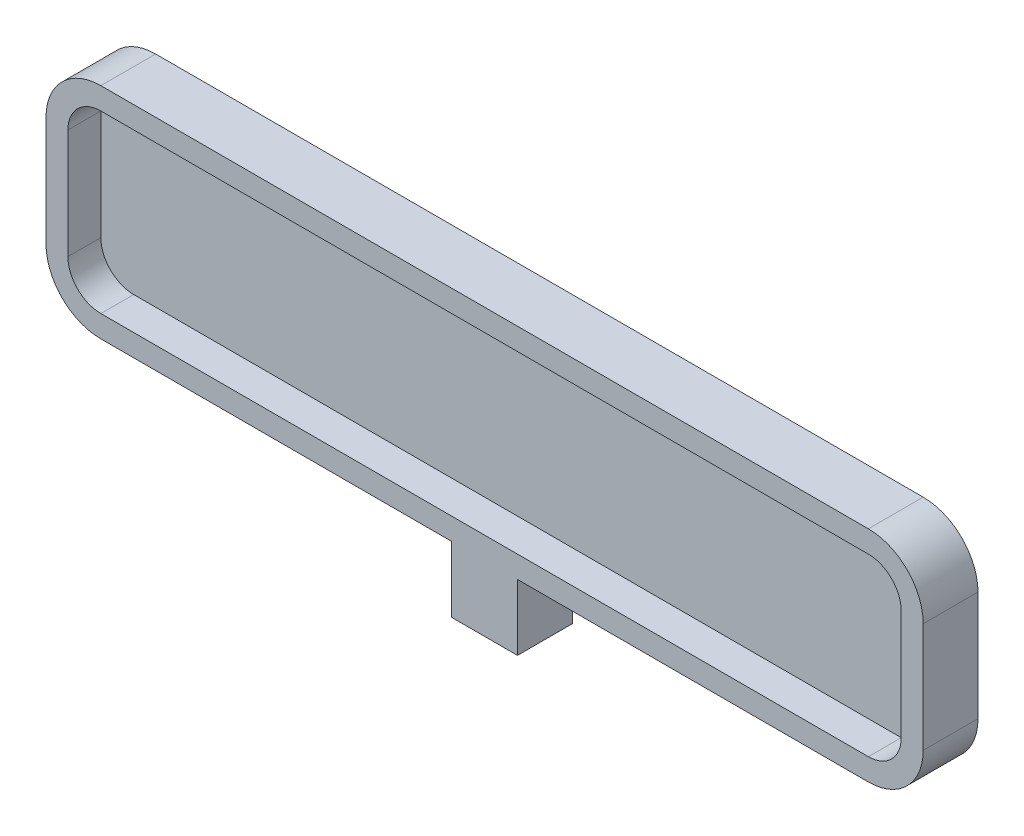
ISO-10303-21;
HEADER;
FILE_DESCRIPTION(('STEP AP214'),'2;1');
FILE_NAME('part.step','',(''),(''),'','','');
FILE_SCHEMA(('AUTOMOTIVE_DESIGN { 1 0 10303 214 1 1 1 1 }'));
ENDSEC;
DATA;
#1=APPLICATION_CONTEXT('core data for automotive mechanical design processes');
#2=APPLICATION_PROTOCOL_DEFINITION('international standard','automotive_design',2000,#1);
#3=PRODUCT_CONTEXT('',#1,'mechanical');
#4=PRODUCT('Part','Part','',(#3));
#5=PRODUCT_RELATED_PRODUCT_CATEGORY('part','',(#4));
#6=PRODUCT_DEFINITION_FORMATION('','',#4);
#7=PRODUCT_DEFINITION_CONTEXT('part definition',#1,'design');
#8=PRODUCT_DEFINITION('design','',#6,#7);
#9=PRODUCT_DEFINITION_SHAPE('','',#8);
#10=(LENGTH_UNIT() NAMED_UNIT(*) SI_UNIT(.MILLI.,.METRE.));
#11=(NAMED_UNIT(*) PLANE_ANGLE_UNIT() SI_UNIT($,.RADIAN.));
#12=(NAMED_UNIT(*) SI_UNIT($,.STERADIAN.) SOLID_ANGLE_UNIT());
#13=UNCERTAINTY_MEASURE_WITH_UNIT(LENGTH_MEASURE(1.E-05),#10,'distance_accuracy_value','');
#14=(GEOMETRIC_REPRESENTATION_CONTEXT(3) GLOBAL_UNCERTAINTY_ASSIGNED_CONTEXT((#13)) GLOBAL_UNIT_ASSIGNED_CONTEXT((#10,
#11,#12)) REPRESENTATION_CONTEXT('',''));
#15=CARTESIAN_POINT('',(0.,0.,0.));
#16=DIRECTION('',(0.,0.,1.));
#17=DIRECTION('',(1.,0.,0.));
#18=AXIS2_PLACEMENT_3D('',#15,#16,#17);
#19=CARTESIAN_POINT('',(40.,-9.99999999999999,5.));
#20=DIRECTION('',(0.,1.,0.));
#21=DIRECTION('',(-1.,0.,0.));
#22=AXIS2_PLACEMENT_3D('',#19,#20,#21);
#23=PLANE('',#22);
#24=DIRECTION('',(0.,0.,-1.));
#25=VECTOR('',#24,1.);
#26=CARTESIAN_POINT('',(-3.,-10.,0.));
#27=LINE('',#26,#25);
#28=CARTESIAN_POINT('',(-3.,-10.,5.));
#29=VERTEX_POINT('',#28);
#30=CARTESIAN_POINT('',(-3.,-10.,0.));
#31=VERTEX_POINT('',#30);
#32=EDGE_CURVE('E63',#29,#31,#27,.T.);
#33=ORIENTED_EDGE('',*,*,#32,.F.);
#34=DIRECTION('',(1.,0.,0.));
#35=VECTOR('',#34,1.);
#36=CARTESIAN_POINT('',(40.,-9.99999999999999,5.));
#37=LINE('',#36,#35);
#38=CARTESIAN_POINT('',(-35.,-10.,5.));
#39=VERTEX_POINT('',#38);
#40=EDGE_CURVE('E301',#39,#29,#37,.T.);
#41=ORIENTED_EDGE('',*,*,#40,.F.);
#42=DIRECTION('',(0.,0.,-1.));
#43=VECTOR('',#42,1.);
#44=CARTESIAN_POINT('',(-35.,-10.,5.));
#45=LINE('',#44,#43);
#46=CARTESIAN_POINT('',(-35.,-10.,0.));
#47=VERTEX_POINT('',#46);
#48=EDGE_CURVE('E329',#39,#47,#45,.T.);
#49=ORIENTED_EDGE('',*,*,#48,.T.);
#50=DIRECTION('',(1.,0.,0.));
#51=VECTOR('',#50,1.);
#52=CARTESIAN_POINT('',(40.,-9.99999999999999,0.));
#53=LINE('',#52,#51);
#54=EDGE_CURVE('E317',#47,#31,#53,.T.);
#55=ORIENTED_EDGE('',*,*,#54,.T.);
#56=EDGE_LOOP('',(#33,#41,#49,#55));
#57=FACE_BOUND('',#56,.T.);
#58=ADVANCED_FACE('F39',(#57),#23,.F.);
#59=DIRECTION('',(0.,0.,1.));
#60=VECTOR('',#59,1.);
#61=CARTESIAN_POINT('',(3.,-10.,0.));
#62=LINE('',#61,#60);
#63=CARTESIAN_POINT('',(3.,-10.,0.));
#64=VERTEX_POINT('',#63);
#65=CARTESIAN_POINT('',(3.,-10.,5.));
#66=VERTEX_POINT('',#65);
#67=EDGE_CURVE('E201',#64,#66,#62,.T.);
#68=ORIENTED_EDGE('',*,*,#67,.F.);
#69=CARTESIAN_POINT('',(35.,-9.99999999999999,0.));
#70=VERTEX_POINT('',#69);
#71=EDGE_CURVE('E316',#64,#70,#53,.T.);
#72=ORIENTED_EDGE('',*,*,#71,.T.);
#73=DIRECTION('',(0.,0.,-1.));
#74=VECTOR('',#73,1.);
#75=CARTESIAN_POINT('',(35.,-9.99999999999999,5.));
#76=LINE('',#75,#74);
#77=CARTESIAN_POINT('',(35.,-9.99999999999999,5.));
#78=VERTEX_POINT('',#77);
#79=EDGE_CURVE('E312',#70,#78,#76,.F.);
#80=ORIENTED_EDGE('',*,*,#79,.T.);
#81=EDGE_CURVE('E55',#66,#78,#37,.T.);
#82=ORIENTED_EDGE('',*,*,#81,.F.);
#83=EDGE_LOOP('',(#68,#72,#80,#82));
#84=FACE_BOUND('',#83,.T.);
#85=ADVANCED_FACE('F433',(#84),#23,.F.);
#86=CARTESIAN_POINT('',(-40.,-10.,5.));
#87=DIRECTION('',(1.,0.,0.));
#88=DIRECTION('',(0.,0.,-1.));
#89=AXIS2_PLACEMENT_3D('',#86,#87,#88);
#90=PLANE('',#89);
#91=DIRECTION('',(0.,-1.,0.));
#92=VECTOR('',#91,1.);
#93=CARTESIAN_POINT('',(-40.,-10.,0.));
#94=LINE('',#93,#92);
#95=CARTESIAN_POINT('',(-40.,4.99999999999999,0.));
#96=VERTEX_POINT('',#95);
#97=CARTESIAN_POINT('',(-40.,-5.,0.));
#98=VERTEX_POINT('',#97);
#99=EDGE_CURVE('E269',#96,#98,#94,.T.);
#100=ORIENTED_EDGE('',*,*,#99,.T.);
#101=DIRECTION('',(0.,0.,-1.));
#102=VECTOR('',#101,1.);
#103=CARTESIAN_POINT('',(-40.,-5.,5.));
#104=LINE('',#103,#102);
#105=CARTESIAN_POINT('',(-40.,-5.,5.));
#106=VERTEX_POINT('',#105);
#107=EDGE_CURVE('E350',#98,#106,#104,.F.);
#108=ORIENTED_EDGE('',*,*,#107,.T.);
#109=DIRECTION('',(0.,-1.,0.));
#110=VECTOR('',#109,1.);
#111=CARTESIAN_POINT('',(-40.,-10.,5.));
#112=LINE('',#111,#110);
#113=CARTESIAN_POINT('',(-40.,4.99999999999999,5.));
#114=VERTEX_POINT('',#113);
#115=EDGE_CURVE('E296',#114,#106,#112,.T.);
#116=ORIENTED_EDGE('',*,*,#115,.F.);
#117=DIRECTION('',(0.,0.,-1.));
#118=VECTOR('',#117,1.);
#119=CARTESIAN_POINT('',(-40.,4.99999999999999,5.));
#120=LINE('',#119,#118);
#121=EDGE_CURVE('E346',#114,#96,#120,.T.);
#122=ORIENTED_EDGE('',*,*,#121,.T.);
#123=EDGE_LOOP('',(#100,#108,#116,#122));
#124=FACE_BOUND('',#123,.T.);
#125=ADVANCED_FACE('F387',(#124),#90,.F.);
#126=CARTESIAN_POINT('',(40.,-9.99999999999999,5.));
#127=DIRECTION('',(-1.,0.,0.));
#128=DIRECTION('',(0.,0.,1.));
#129=AXIS2_PLACEMENT_3D('',#126,#127,#128);
#130=PLANE('',#129);
#131=DIRECTION('',(0.,1.,0.));
#132=VECTOR('',#131,1.);
#133=CARTESIAN_POINT('',(40.,-9.99999999999999,5.));
#134=LINE('',#133,#132);
#135=CARTESIAN_POINT('',(40.,-5.,5.));
#136=VERTEX_POINT('',#135);
#137=CARTESIAN_POINT('',(40.,5.,5.));
#138=VERTEX_POINT('',#137);
#139=EDGE_CURVE('E304',#136,#138,#134,.T.);
#140=ORIENTED_EDGE('',*,*,#139,.F.);
#141=DIRECTION('',(0.,0.,-1.));
#142=VECTOR('',#141,1.);
#143=CARTESIAN_POINT('',(40.,-5.,5.));
#144=LINE('',#143,#142);
#145=CARTESIAN_POINT('',(40.,-5.,0.));
#146=VERTEX_POINT('',#145);
#147=EDGE_CURVE('E368',#136,#146,#144,.T.);
#148=ORIENTED_EDGE('',*,*,#147,.T.);
#149=DIRECTION('',(0.,1.,0.));
#150=VECTOR('',#149,1.);
#151=CARTESIAN_POINT('',(40.,-9.99999999999999,0.));
#152=LINE('',#151,#150);
#153=CARTESIAN_POINT('',(40.,5.,0.));
#154=VERTEX_POINT('',#153);
#155=EDGE_CURVE('E320',#146,#154,#152,.T.);
#156=ORIENTED_EDGE('',*,*,#155,.T.);
#157=DIRECTION('',(0.,0.,-1.));
#158=VECTOR('',#157,1.);
#159=CARTESIAN_POINT('',(40.,5.,5.));
#160=LINE('',#159,#158);
#161=EDGE_CURVE('E365',#154,#138,#160,.F.);
#162=ORIENTED_EDGE('',*,*,#161,.T.);
#163=EDGE_LOOP('',(#140,#148,#156,#162));
#164=FACE_BOUND('',#163,.T.);
#165=ADVANCED_FACE('F440',(#164),#130,.F.);
#166=CARTESIAN_POINT('',(40.,10.,5.));
#167=DIRECTION('',(0.,-1.,0.));
#168=DIRECTION('',(1.,0.,0.));
#169=AXIS2_PLACEMENT_3D('',#166,#167,#168);
#170=PLANE('',#169);
#171=DIRECTION('',(-1.,0.,0.));
#172=VECTOR('',#171,1.);
#173=CARTESIAN_POINT('',(40.,10.,5.));
#174=LINE('',#173,#172);
#175=CARTESIAN_POINT('',(35.,10.,5.));
#176=VERTEX_POINT('',#175);
#177=CARTESIAN_POINT('',(-35.,9.99999999999999,5.));
#178=VERTEX_POINT('',#177);
#179=EDGE_CURVE('E308',#176,#178,#174,.T.);
#180=ORIENTED_EDGE('',*,*,#179,.F.);
#181=DIRECTION('',(0.,0.,-1.));
#182=VECTOR('',#181,1.);
#183=CARTESIAN_POINT('',(35.,10.,5.));
#184=LINE('',#183,#182);
#185=CARTESIAN_POINT('',(35.,10.,0.));
#186=VERTEX_POINT('',#185);
#187=EDGE_CURVE('E11',#176,#186,#184,.T.);
#188=ORIENTED_EDGE('',*,*,#187,.T.);
#189=DIRECTION('',(-1.,0.,0.));
#190=VECTOR('',#189,1.);
#191=CARTESIAN_POINT('',(40.,10.,0.));
#192=LINE('',#191,#190);
#193=CARTESIAN_POINT('',(-35.,9.99999999999999,0.));
#194=VERTEX_POINT('',#193);
#195=EDGE_CURVE('E300',#186,#194,#192,.T.);
#196=ORIENTED_EDGE('',*,*,#195,.T.);
#197=DIRECTION('',(0.,0.,-1.));
#198=VECTOR('',#197,1.);
#199=CARTESIAN_POINT('',(-35.,9.99999999999999,5.));
#200=LINE('',#199,#198);
#201=EDGE_CURVE('E48',#194,#178,#200,.F.);
#202=ORIENTED_EDGE('',*,*,#201,.T.);
#203=EDGE_LOOP('',(#180,#188,#196,#202));
#204=FACE_BOUND('',#203,.T.);
#205=ADVANCED_FACE('F375',(#204),#170,.F.);
#206=CARTESIAN_POINT('',(0.,0.,5.));
#207=DIRECTION('',(0.,0.,1.));
#208=DIRECTION('',(1.,0.,0.));
#209=AXIS2_PLACEMENT_3D('',#206,#207,#208);
#210=PLANE('',#209);
#211=DIRECTION('',(0.,-1.,0.));
#212=VECTOR('',#211,1.);
#213=CARTESIAN_POINT('',(-38.,-10.,5.));
#214=LINE('',#213,#212);
#215=CARTESIAN_POINT('',(-38.,4.99999999999999,5.));
#216=VERTEX_POINT('',#215);
#217=CARTESIAN_POINT('',(-38.,-5.,5.));
#218=VERTEX_POINT('',#217);
#219=EDGE_CURVE('E241',#216,#218,#214,.T.);
#220=ORIENTED_EDGE('',*,*,#219,.F.);
#221=CARTESIAN_POINT('',(-35.,4.99999999999999,5.));
#222=DIRECTION('',(0.,0.,1.));
#223=DIRECTION('',(1.,0.,0.));
#224=AXIS2_PLACEMENT_3D('',#221,#222,#223);
#225=CIRCLE('',#224,3.);
#226=CARTESIAN_POINT('',(-35.,7.99999999999999,5.));
#227=VERTEX_POINT('',#226);
#228=EDGE_CURVE('E219',#227,#216,#225,.T.);
#229=ORIENTED_EDGE('',*,*,#228,.F.);
#230=DIRECTION('',(-1.,0.,0.));
#231=VECTOR('',#230,1.);
#232=CARTESIAN_POINT('',(40.,8.00000000000001,5.));
#233=LINE('',#232,#231);
#234=CARTESIAN_POINT('',(35.,8.00000000000001,5.));
#235=VERTEX_POINT('',#234);
#236=EDGE_CURVE('E255',#235,#227,#233,.T.);
#237=ORIENTED_EDGE('',*,*,#236,.F.);
#238=CARTESIAN_POINT('',(35.,5.,5.));
#239=DIRECTION('',(0.,0.,1.));
#240=DIRECTION('',(1.,0.,0.));
#241=AXIS2_PLACEMENT_3D('',#238,#239,#240);
#242=CIRCLE('',#241,3.);
#243=CARTESIAN_POINT('',(38.,5.,5.));
#244=VERTEX_POINT('',#243);
#245=EDGE_CURVE('E286',#244,#235,#242,.T.);
#246=ORIENTED_EDGE('',*,*,#245,.F.);
#247=DIRECTION('',(0.,1.,0.));
#248=VECTOR('',#247,1.);
#249=CARTESIAN_POINT('',(38.,-9.99999999999999,5.));
#250=LINE('',#249,#248);
#251=CARTESIAN_POINT('',(38.,-5.,5.));
#252=VERTEX_POINT('',#251);
#253=EDGE_CURVE('E283',#252,#244,#250,.T.);
#254=ORIENTED_EDGE('',*,*,#253,.F.);
#255=CARTESIAN_POINT('',(35.,-5.,5.));
#256=DIRECTION('',(0.,0.,1.));
#257=DIRECTION('',(1.,0.,0.));
#258=AXIS2_PLACEMENT_3D('',#255,#256,#257);
#259=CIRCLE('',#258,3.);
#260=CARTESIAN_POINT('',(35.,-7.99999999999999,5.));
#261=VERTEX_POINT('',#260);
#262=EDGE_CURVE('E279',#261,#252,#259,.T.);
#263=ORIENTED_EDGE('',*,*,#262,.F.);
#264=DIRECTION('',(1.,0.,0.));
#265=VECTOR('',#264,1.);
#266=CARTESIAN_POINT('',(40.,-7.99999999999999,5.));
#267=LINE('',#266,#265);
#268=CARTESIAN_POINT('',(-35.,-8.00000000000001,5.));
#269=VERTEX_POINT('',#268);
#270=EDGE_CURVE('E276',#269,#261,#267,.T.);
#271=ORIENTED_EDGE('',*,*,#270,.F.);
#272=CARTESIAN_POINT('',(-35.,-5.,5.));
#273=DIRECTION('',(0.,0.,1.));
#274=DIRECTION('',(1.,0.,0.));
#275=AXIS2_PLACEMENT_3D('',#272,#273,#274);
#276=CIRCLE('',#275,3.);
#277=EDGE_CURVE('E264',#218,#269,#276,.T.);
#278=ORIENTED_EDGE('',*,*,#277,.F.);
#279=EDGE_LOOP('',(#220,#229,#237,#246,#254,#263,#271,#278));
#280=FACE_BOUND('',#279,.T.);
#281=ORIENTED_EDGE('',*,*,#115,.T.);
#282=CARTESIAN_POINT('',(-35.,-5.,5.));
#283=DIRECTION('',(0.,0.,1.));
#284=DIRECTION('',(1.,0.,0.));
#285=AXIS2_PLACEMENT_3D('',#282,#283,#284);
#286=CIRCLE('',#285,5.);
#287=EDGE_CURVE('E362',#106,#39,#286,.T.);
#288=ORIENTED_EDGE('',*,*,#287,.T.);
#289=ORIENTED_EDGE('',*,*,#40,.T.);
#290=DIRECTION('',(0.,1.,0.));
#291=VECTOR('',#290,1.);
#292=CARTESIAN_POINT('',(-3.,-16.,5.));
#293=LINE('',#292,#291);
#294=CARTESIAN_POINT('',(-3.,-16.,5.));
#295=VERTEX_POINT('',#294);
#296=EDGE_CURVE('E393',#295,#29,#293,.T.);
#297=ORIENTED_EDGE('',*,*,#296,.F.);
#298=DIRECTION('',(-1.,0.,0.));
#299=VECTOR('',#298,1.);
#300=CARTESIAN_POINT('',(3.,-16.,5.));
#301=LINE('',#300,#299);
#302=CARTESIAN_POINT('',(3.,-16.,5.));
#303=VERTEX_POINT('',#302);
#304=EDGE_CURVE('E196',#303,#295,#301,.T.);
#305=ORIENTED_EDGE('',*,*,#304,.F.);
#306=DIRECTION('',(0.,1.,0.));
#307=VECTOR('',#306,1.);
#308=CARTESIAN_POINT('',(3.,-16.,5.));
#309=LINE('',#308,#307);
#310=EDGE_CURVE('E212',#303,#66,#309,.T.);
#311=ORIENTED_EDGE('',*,*,#310,.T.);
#312=ORIENTED_EDGE('',*,*,#81,.T.);
#313=CARTESIAN_POINT('',(35.,-5.,5.));
#314=DIRECTION('',(0.,0.,1.));
#315=DIRECTION('',(1.,0.,0.));
#316=AXIS2_PLACEMENT_3D('',#313,#314,#315);
#317=CIRCLE('',#316,5.);
#318=EDGE_CURVE('E359',#78,#136,#317,.T.);
#319=ORIENTED_EDGE('',*,*,#318,.T.);
#320=ORIENTED_EDGE('',*,*,#139,.T.);
#321=CARTESIAN_POINT('',(35.,5.,5.));
#322=DIRECTION('',(0.,0.,1.));
#323=DIRECTION('',(1.,0.,0.));
#324=AXIS2_PLACEMENT_3D('',#321,#322,#323);
#325=CIRCLE('',#324,5.);
#326=EDGE_CURVE('E356',#138,#176,#325,.T.);
#327=ORIENTED_EDGE('',*,*,#326,.T.);
#328=ORIENTED_EDGE('',*,*,#179,.T.);
#329=CARTESIAN_POINT('',(-35.,4.99999999999999,5.));
#330=DIRECTION('',(0.,0.,1.));
#331=DIRECTION('',(1.,0.,0.));
#332=AXIS2_PLACEMENT_3D('',#329,#330,#331);
#333=CIRCLE('',#332,5.);
#334=EDGE_CURVE('E353',#178,#114,#333,.T.);
#335=ORIENTED_EDGE('',*,*,#334,.T.);
#336=EDGE_LOOP('',(#281,#288,#289,#297,#305,#311,#312,#319,#320,#327,#328,#335));
#337=FACE_BOUND('',#336,.T.);
#338=ADVANCED_FACE('F381',(#280,#337),#210,.T.);
#339=CARTESIAN_POINT('',(0.,0.,0.));
#340=DIRECTION('',(0.,0.,1.));
#341=DIRECTION('',(1.,0.,0.));
#342=AXIS2_PLACEMENT_3D('',#339,#340,#341);
#343=PLANE('',#342);
#344=ORIENTED_EDGE('',*,*,#54,.F.);
#345=CARTESIAN_POINT('',(-35.,-5.,0.));
#346=DIRECTION('',(0.,0.,1.));
#347=DIRECTION('',(1.,0.,0.));
#348=AXIS2_PLACEMENT_3D('',#345,#346,#347);
#349=CIRCLE('',#348,5.);
#350=EDGE_CURVE('E343',#47,#98,#349,.F.);
#351=ORIENTED_EDGE('',*,*,#350,.T.);
#352=ORIENTED_EDGE('',*,*,#99,.F.);
#353=CARTESIAN_POINT('',(-35.,4.99999999999999,0.));
#354=DIRECTION('',(0.,0.,1.));
#355=DIRECTION('',(1.,0.,0.));
#356=AXIS2_PLACEMENT_3D('',#353,#354,#355);
#357=CIRCLE('',#356,5.);
#358=EDGE_CURVE('E333',#96,#194,#357,.F.);
#359=ORIENTED_EDGE('',*,*,#358,.T.);
#360=ORIENTED_EDGE('',*,*,#195,.F.);
#361=CARTESIAN_POINT('',(35.,5.,0.));
#362=DIRECTION('',(0.,0.,1.));
#363=DIRECTION('',(1.,0.,0.));
#364=AXIS2_PLACEMENT_3D('',#361,#362,#363);
#365=CIRCLE('',#364,5.);
#366=EDGE_CURVE('E336',#186,#154,#365,.F.);
#367=ORIENTED_EDGE('',*,*,#366,.T.);
#368=ORIENTED_EDGE('',*,*,#155,.F.);
#369=CARTESIAN_POINT('',(35.,-5.,0.));
#370=DIRECTION('',(0.,0.,1.));
#371=DIRECTION('',(1.,0.,0.));
#372=AXIS2_PLACEMENT_3D('',#369,#370,#371);
#373=CIRCLE('',#372,5.);
#374=EDGE_CURVE('E339',#146,#70,#373,.F.);
#375=ORIENTED_EDGE('',*,*,#374,.T.);
#376=ORIENTED_EDGE('',*,*,#71,.F.);
#377=DIRECTION('',(0.,1.,0.));
#378=VECTOR('',#377,1.);
#379=CARTESIAN_POINT('',(3.,-16.,0.));
#380=LINE('',#379,#378);
#381=CARTESIAN_POINT('',(3.,-16.,0.));
#382=VERTEX_POINT('',#381);
#383=EDGE_CURVE('E186',#382,#64,#380,.T.);
#384=ORIENTED_EDGE('',*,*,#383,.F.);
#385=DIRECTION('',(1.,0.,0.));
#386=VECTOR('',#385,1.);
#387=CARTESIAN_POINT('',(3.,-16.,0.));
#388=LINE('',#387,#386);
#389=CARTESIAN_POINT('',(-3.,-16.,0.));
#390=VERTEX_POINT('',#389);
#391=EDGE_CURVE('E179',#390,#382,#388,.T.);
#392=ORIENTED_EDGE('',*,*,#391,.F.);
#393=DIRECTION('',(0.,1.,0.));
#394=VECTOR('',#393,1.);
#395=CARTESIAN_POINT('',(-3.,-16.,0.));
#396=LINE('',#395,#394);
#397=EDGE_CURVE('E184',#390,#31,#396,.T.);
#398=ORIENTED_EDGE('',*,*,#397,.T.);
#399=EDGE_LOOP('',(#344,#351,#352,#359,#360,#367,#368,#375,#376,#384,#392,#398));
#400=FACE_BOUND('',#399,.T.);
#401=ADVANCED_FACE('F182',(#400),#343,.F.);
#402=CARTESIAN_POINT('',(-35.,-5.,5.));
#403=DIRECTION('',(0.,0.,-1.));
#404=DIRECTION('',(-1.,0.,0.));
#405=AXIS2_PLACEMENT_3D('',#402,#403,#404);
#406=CYLINDRICAL_SURFACE('',#405,5.);
#407=ORIENTED_EDGE('',*,*,#287,.F.);
#408=ORIENTED_EDGE('',*,*,#107,.F.);
#409=ORIENTED_EDGE('',*,*,#350,.F.);
#410=ORIENTED_EDGE('',*,*,#48,.F.);
#411=EDGE_LOOP('',(#407,#408,#409,#410));
#412=FACE_BOUND('',#411,.T.);
#413=ADVANCED_FACE('F392',(#412),#406,.T.);
#414=CARTESIAN_POINT('',(35.,-5.,5.));
#415=DIRECTION('',(0.,0.,-1.));
#416=DIRECTION('',(-1.,0.,0.));
#417=AXIS2_PLACEMENT_3D('',#414,#415,#416);
#418=CYLINDRICAL_SURFACE('',#417,5.);
#419=ORIENTED_EDGE('',*,*,#318,.F.);
#420=ORIENTED_EDGE('',*,*,#79,.F.);
#421=ORIENTED_EDGE('',*,*,#374,.F.);
#422=ORIENTED_EDGE('',*,*,#147,.F.);
#423=EDGE_LOOP('',(#419,#420,#421,#422));
#424=FACE_BOUND('',#423,.T.);
#425=ADVANCED_FACE('F446',(#424),#418,.T.);
#426=CARTESIAN_POINT('',(35.,5.,5.));
#427=DIRECTION('',(0.,0.,-1.));
#428=DIRECTION('',(-1.,0.,0.));
#429=AXIS2_PLACEMENT_3D('',#426,#427,#428);
#430=CYLINDRICAL_SURFACE('',#429,5.);
#431=ORIENTED_EDGE('',*,*,#326,.F.);
#432=ORIENTED_EDGE('',*,*,#161,.F.);
#433=ORIENTED_EDGE('',*,*,#366,.F.);
#434=ORIENTED_EDGE('',*,*,#187,.F.);
#435=EDGE_LOOP('',(#431,#432,#433,#434));
#436=FACE_BOUND('',#435,.T.);
#437=ADVANCED_FACE('F448',(#436),#430,.T.);
#438=CARTESIAN_POINT('',(-35.,4.99999999999999,5.));
#439=DIRECTION('',(0.,0.,-1.));
#440=DIRECTION('',(-1.,0.,0.));
#441=AXIS2_PLACEMENT_3D('',#438,#439,#440);
#442=CYLINDRICAL_SURFACE('',#441,5.);
#443=ORIENTED_EDGE('',*,*,#334,.F.);
#444=ORIENTED_EDGE('',*,*,#201,.F.);
#445=ORIENTED_EDGE('',*,*,#358,.F.);
#446=ORIENTED_EDGE('',*,*,#121,.F.);
#447=EDGE_LOOP('',(#443,#444,#445,#446));
#448=FACE_BOUND('',#447,.T.);
#449=ADVANCED_FACE('F41',(#448),#442,.T.);
#450=CARTESIAN_POINT('',(-38.,-10.,5.));
#451=DIRECTION('',(1.,0.,0.));
#452=DIRECTION('',(0.,0.,-1.));
#453=AXIS2_PLACEMENT_3D('',#450,#451,#452);
#454=PLANE('',#453);
#455=DIRECTION('',(0.,-1.,0.));
#456=VECTOR('',#455,1.);
#457=CARTESIAN_POINT('',(-38.,-10.,2.));
#458=LINE('',#457,#456);
#459=CARTESIAN_POINT('',(-38.,4.99999999999999,2.));
#460=VERTEX_POINT('',#459);
#461=CARTESIAN_POINT('',(-38.,-5.,2.));
#462=VERTEX_POINT('',#461);
#463=EDGE_CURVE('E205',#460,#462,#458,.T.);
#464=ORIENTED_EDGE('',*,*,#463,.F.);
#465=DIRECTION('',(0.,0.,-1.));
#466=VECTOR('',#465,1.);
#467=CARTESIAN_POINT('',(-38.,4.99999999999999,5.));
#468=LINE('',#467,#466);
#469=EDGE_CURVE('E220',#216,#460,#468,.T.);
#470=ORIENTED_EDGE('',*,*,#469,.F.);
#471=ORIENTED_EDGE('',*,*,#219,.T.);
#472=DIRECTION('',(0.,0.,-1.));
#473=VECTOR('',#472,1.);
#474=CARTESIAN_POINT('',(-38.,-5.,5.));
#475=LINE('',#474,#473);
#476=EDGE_CURVE('E216',#462,#218,#475,.F.);
#477=ORIENTED_EDGE('',*,*,#476,.F.);
#478=EDGE_LOOP('',(#464,#470,#471,#477));
#479=FACE_BOUND('',#478,.T.);
#480=ADVANCED_FACE('F455',(#479),#454,.T.);
#481=CARTESIAN_POINT('',(40.,-7.99999999999999,5.));
#482=DIRECTION('',(0.,1.,0.));
#483=DIRECTION('',(-1.,0.,0.));
#484=AXIS2_PLACEMENT_3D('',#481,#482,#483);
#485=PLANE('',#484);
#486=ORIENTED_EDGE('',*,*,#270,.T.);
#487=DIRECTION('',(0.,0.,1.));
#488=VECTOR('',#487,1.);
#489=CARTESIAN_POINT('',(35.,-7.99999999999999,5.));
#490=LINE('',#489,#488);
#491=CARTESIAN_POINT('',(35.,-7.99999999999999,2.));
#492=VERTEX_POINT('',#491);
#493=EDGE_CURVE('E252',#492,#261,#490,.T.);
#494=ORIENTED_EDGE('',*,*,#493,.F.);
#495=DIRECTION('',(1.,0.,0.));
#496=VECTOR('',#495,1.);
#497=CARTESIAN_POINT('',(40.,-7.99999999999999,2.));
#498=LINE('',#497,#496);
#499=CARTESIAN_POINT('',(-35.,-8.00000000000001,2.));
#500=VERTEX_POINT('',#499);
#501=EDGE_CURVE('E210',#500,#492,#498,.T.);
#502=ORIENTED_EDGE('',*,*,#501,.F.);
#503=DIRECTION('',(0.,0.,1.));
#504=VECTOR('',#503,1.);
#505=CARTESIAN_POINT('',(-35.,-8.00000000000001,5.));
#506=LINE('',#505,#504);
#507=EDGE_CURVE('E236',#269,#500,#506,.F.);
#508=ORIENTED_EDGE('',*,*,#507,.F.);
#509=EDGE_LOOP('',(#486,#494,#502,#508));
#510=FACE_BOUND('',#509,.T.);
#511=ADVANCED_FACE('F505',(#510),#485,.T.);
#512=CARTESIAN_POINT('',(38.,-9.99999999999999,5.));
#513=DIRECTION('',(-1.,0.,0.));
#514=DIRECTION('',(0.,0.,1.));
#515=AXIS2_PLACEMENT_3D('',#512,#513,#514);
#516=PLANE('',#515);
#517=ORIENTED_EDGE('',*,*,#253,.T.);
#518=DIRECTION('',(0.,0.,1.));
#519=VECTOR('',#518,1.);
#520=CARTESIAN_POINT('',(38.,5.,5.));
#521=LINE('',#520,#519);
#522=CARTESIAN_POINT('',(38.,5.,2.));
#523=VERTEX_POINT('',#522);
#524=EDGE_CURVE('E261',#523,#244,#521,.T.);
#525=ORIENTED_EDGE('',*,*,#524,.F.);
#526=DIRECTION('',(0.,1.,0.));
#527=VECTOR('',#526,1.);
#528=CARTESIAN_POINT('',(38.,-9.99999999999999,2.));
#529=LINE('',#528,#527);
#530=CARTESIAN_POINT('',(38.,-5.,2.));
#531=VERTEX_POINT('',#530);
#532=EDGE_CURVE('E228',#531,#523,#529,.T.);
#533=ORIENTED_EDGE('',*,*,#532,.F.);
#534=DIRECTION('',(0.,0.,1.));
#535=VECTOR('',#534,1.);
#536=CARTESIAN_POINT('',(38.,-5.,5.));
#537=LINE('',#536,#535);
#538=EDGE_CURVE('E256',#252,#531,#537,.F.);
#539=ORIENTED_EDGE('',*,*,#538,.F.);
#540=EDGE_LOOP('',(#517,#525,#533,#539));
#541=FACE_BOUND('',#540,.T.);
#542=ADVANCED_FACE('F501',(#541),#516,.T.);
#543=CARTESIAN_POINT('',(40.,8.00000000000001,5.));
#544=DIRECTION('',(0.,-1.,0.));
#545=DIRECTION('',(1.,0.,0.));
#546=AXIS2_PLACEMENT_3D('',#543,#544,#545);
#547=PLANE('',#546);
#548=ORIENTED_EDGE('',*,*,#236,.T.);
#549=DIRECTION('',(0.,0.,1.));
#550=VECTOR('',#549,1.);
#551=CARTESIAN_POINT('',(-35.,7.99999999999999,5.));
#552=LINE('',#551,#550);
#553=CARTESIAN_POINT('',(-35.,7.99999999999999,2.));
#554=VERTEX_POINT('',#553);
#555=EDGE_CURVE('E260',#554,#227,#552,.T.);
#556=ORIENTED_EDGE('',*,*,#555,.F.);
#557=DIRECTION('',(-1.,0.,0.));
#558=VECTOR('',#557,1.);
#559=CARTESIAN_POINT('',(40.,8.00000000000001,2.));
#560=LINE('',#559,#558);
#561=CARTESIAN_POINT('',(35.,8.00000000000001,2.));
#562=VERTEX_POINT('',#561);
#563=EDGE_CURVE('E237',#562,#554,#560,.T.);
#564=ORIENTED_EDGE('',*,*,#563,.F.);
#565=DIRECTION('',(0.,0.,1.));
#566=VECTOR('',#565,1.);
#567=CARTESIAN_POINT('',(35.,8.00000000000001,5.));
#568=LINE('',#567,#566);
#569=EDGE_CURVE('E265',#235,#562,#568,.F.);
#570=ORIENTED_EDGE('',*,*,#569,.F.);
#571=EDGE_LOOP('',(#548,#556,#564,#570));
#572=FACE_BOUND('',#571,.T.);
#573=ADVANCED_FACE('F497',(#572),#547,.T.);
#574=CARTESIAN_POINT('',(0.,0.,2.));
#575=DIRECTION('',(0.,0.,1.));
#576=DIRECTION('',(1.,0.,0.));
#577=AXIS2_PLACEMENT_3D('',#574,#575,#576);
#578=PLANE('',#577);
#579=ORIENTED_EDGE('',*,*,#501,.T.);
#580=CARTESIAN_POINT('',(35.,-5.,2.));
#581=DIRECTION('',(0.,0.,1.));
#582=DIRECTION('',(1.,0.,0.));
#583=AXIS2_PLACEMENT_3D('',#580,#581,#582);
#584=CIRCLE('',#583,3.);
#585=EDGE_CURVE('E231',#531,#492,#584,.F.);
#586=ORIENTED_EDGE('',*,*,#585,.F.);
#587=ORIENTED_EDGE('',*,*,#532,.T.);
#588=CARTESIAN_POINT('',(35.,5.,2.));
#589=DIRECTION('',(0.,0.,1.));
#590=DIRECTION('',(1.,0.,0.));
#591=AXIS2_PLACEMENT_3D('',#588,#589,#590);
#592=CIRCLE('',#591,3.);
#593=EDGE_CURVE('E235',#562,#523,#592,.F.);
#594=ORIENTED_EDGE('',*,*,#593,.F.);
#595=ORIENTED_EDGE('',*,*,#563,.T.);
#596=CARTESIAN_POINT('',(-35.,4.99999999999999,2.));
#597=DIRECTION('',(0.,0.,1.));
#598=DIRECTION('',(1.,0.,0.));
#599=AXIS2_PLACEMENT_3D('',#596,#597,#598);
#600=CIRCLE('',#599,3.);
#601=EDGE_CURVE('E232',#460,#554,#600,.F.);
#602=ORIENTED_EDGE('',*,*,#601,.F.);
#603=ORIENTED_EDGE('',*,*,#463,.T.);
#604=CARTESIAN_POINT('',(-35.,-5.,2.));
#605=DIRECTION('',(0.,0.,1.));
#606=DIRECTION('',(1.,0.,0.));
#607=AXIS2_PLACEMENT_3D('',#604,#605,#606);
#608=CIRCLE('',#607,3.);
#609=EDGE_CURVE('E224',#500,#462,#608,.F.);
#610=ORIENTED_EDGE('',*,*,#609,.F.);
#611=EDGE_LOOP('',(#579,#586,#587,#594,#595,#602,#603,#610));
#612=FACE_BOUND('',#611,.T.);
#613=ADVANCED_FACE('F493',(#612),#578,.T.);
#614=CARTESIAN_POINT('',(-35.,-5.,5.));
#615=DIRECTION('',(0.,0.,-1.));
#616=DIRECTION('',(-1.,0.,0.));
#617=AXIS2_PLACEMENT_3D('',#614,#615,#616);
#618=CYLINDRICAL_SURFACE('',#617,3.);
#619=ORIENTED_EDGE('',*,*,#277,.T.);
#620=ORIENTED_EDGE('',*,*,#507,.T.);
#621=ORIENTED_EDGE('',*,*,#609,.T.);
#622=ORIENTED_EDGE('',*,*,#476,.T.);
#623=EDGE_LOOP('',(#619,#620,#621,#622));
#624=FACE_BOUND('',#623,.T.);
#625=ADVANCED_FACE('F489',(#624),#618,.F.);
#626=CARTESIAN_POINT('',(35.,-5.,5.));
#627=DIRECTION('',(0.,0.,-1.));
#628=DIRECTION('',(-1.,0.,0.));
#629=AXIS2_PLACEMENT_3D('',#626,#627,#628);
#630=CYLINDRICAL_SURFACE('',#629,3.);
#631=ORIENTED_EDGE('',*,*,#262,.T.);
#632=ORIENTED_EDGE('',*,*,#538,.T.);
#633=ORIENTED_EDGE('',*,*,#585,.T.);
#634=ORIENTED_EDGE('',*,*,#493,.T.);
#635=EDGE_LOOP('',(#631,#632,#633,#634));
#636=FACE_BOUND('',#635,.T.);
#637=ADVANCED_FACE('F485',(#636),#630,.F.);
#638=CARTESIAN_POINT('',(35.,5.,5.));
#639=DIRECTION('',(0.,0.,-1.));
#640=DIRECTION('',(-1.,0.,0.));
#641=AXIS2_PLACEMENT_3D('',#638,#639,#640);
#642=CYLINDRICAL_SURFACE('',#641,3.);
#643=ORIENTED_EDGE('',*,*,#245,.T.);
#644=ORIENTED_EDGE('',*,*,#569,.T.);
#645=ORIENTED_EDGE('',*,*,#593,.T.);
#646=ORIENTED_EDGE('',*,*,#524,.T.);
#647=EDGE_LOOP('',(#643,#644,#645,#646));
#648=FACE_BOUND('',#647,.T.);
#649=ADVANCED_FACE('F481',(#648),#642,.F.);
#650=CARTESIAN_POINT('',(-35.,4.99999999999999,5.));
#651=DIRECTION('',(0.,0.,-1.));
#652=DIRECTION('',(-1.,0.,0.));
#653=AXIS2_PLACEMENT_3D('',#650,#651,#652);
#654=CYLINDRICAL_SURFACE('',#653,3.);
#655=ORIENTED_EDGE('',*,*,#228,.T.);
#656=ORIENTED_EDGE('',*,*,#469,.T.);
#657=ORIENTED_EDGE('',*,*,#601,.T.);
#658=ORIENTED_EDGE('',*,*,#555,.T.);
#659=EDGE_LOOP('',(#655,#656,#657,#658));
#660=FACE_BOUND('',#659,.T.);
#661=ADVANCED_FACE('F478',(#660),#654,.F.);
#662=CARTESIAN_POINT('',(-3.,-16.,0.));
#663=DIRECTION('',(1.,0.,0.));
#664=DIRECTION('',(0.,1.,0.));
#665=AXIS2_PLACEMENT_3D('',#662,#663,#664);
#666=PLANE('',#665);
#667=ORIENTED_EDGE('',*,*,#32,.T.);
#668=ORIENTED_EDGE('',*,*,#397,.F.);
#669=DIRECTION('',(0.,0.,-1.));
#670=VECTOR('',#669,1.);
#671=CARTESIAN_POINT('',(-3.,-16.,0.));
#672=LINE('',#671,#670);
#673=EDGE_CURVE('E191',#295,#390,#672,.T.);
#674=ORIENTED_EDGE('',*,*,#673,.F.);
#675=ORIENTED_EDGE('',*,*,#296,.T.);
#676=EDGE_LOOP('',(#667,#668,#674,#675));
#677=FACE_BOUND('',#676,.T.);
#678=ADVANCED_FACE('F203',(#677),#666,.F.);
#679=CARTESIAN_POINT('',(3.,-16.,0.));
#680=DIRECTION('',(-1.,0.,0.));
#681=DIRECTION('',(0.,-1.,0.));
#682=AXIS2_PLACEMENT_3D('',#679,#680,#681);
#683=PLANE('',#682);
#684=ORIENTED_EDGE('',*,*,#67,.T.);
#685=ORIENTED_EDGE('',*,*,#310,.F.);
#686=DIRECTION('',(0.,0.,1.));
#687=VECTOR('',#686,1.);
#688=CARTESIAN_POINT('',(3.,-16.,0.));
#689=LINE('',#688,#687);
#690=EDGE_CURVE('E190',#382,#303,#689,.T.);
#691=ORIENTED_EDGE('',*,*,#690,.F.);
#692=ORIENTED_EDGE('',*,*,#383,.T.);
#693=EDGE_LOOP('',(#684,#685,#691,#692));
#694=FACE_BOUND('',#693,.T.);
#695=ADVANCED_FACE('F425',(#694),#683,.F.);
#696=CARTESIAN_POINT('',(0.,-16.,0.));
#697=DIRECTION('',(0.,-1.,0.));
#698=DIRECTION('',(0.,0.,-1.));
#699=AXIS2_PLACEMENT_3D('',#696,#697,#698);
#700=PLANE('',#699);
#701=CARTESIAN_POINT('',(0.,-16.,2.5));
#702=DIRECTION('',(0.,-1.,0.));
#703=DIRECTION('',(0.,0.,-1.));
#704=AXIS2_PLACEMENT_3D('',#701,#702,#703);
#705=CIRCLE('',#704,2.);
#706=CARTESIAN_POINT('',(0.,-16.,0.5));
#707=VERTEX_POINT('',#706);
#708=EDGE_CURVE('E408',#707,#707,#705,.T.);
#709=ORIENTED_EDGE('',*,*,#708,.F.);
#710=EDGE_LOOP('',(#709));
#711=FACE_BOUND('',#710,.T.);
#712=ORIENTED_EDGE('',*,*,#673,.T.);
#713=ORIENTED_EDGE('',*,*,#391,.T.);
#714=ORIENTED_EDGE('',*,*,#690,.T.);
#715=ORIENTED_EDGE('',*,*,#304,.T.);
#716=EDGE_LOOP('',(#712,#713,#714,#715));
#717=FACE_BOUND('',#716,.T.);
#718=ADVANCED_FACE('F194',(#711,#717),#700,.T.);
#719=CARTESIAN_POINT('',(0.,-12.,2.5));
#720=DIRECTION('',(0.,-1.,0.));
#721=DIRECTION('',(0.,0.,-1.));
#722=AXIS2_PLACEMENT_3D('',#719,#720,#721);
#723=CYLINDRICAL_SURFACE('',#722,2.);
#724=CARTESIAN_POINT('',(0.,-12.,2.5));
#725=DIRECTION('',(0.,-1.,0.));
#726=DIRECTION('',(0.,0.,-1.));
#727=AXIS2_PLACEMENT_3D('',#724,#725,#726);
#728=CIRCLE('',#727,2.);
#729=CARTESIAN_POINT('',(0.,-12.,0.5));
#730=VERTEX_POINT('',#729);
#731=EDGE_CURVE('E404',#730,#730,#728,.T.);
#732=ORIENTED_EDGE('',*,*,#731,.F.);
#733=EDGE_LOOP('',(#732));
#734=FACE_BOUND('',#733,.T.);
#735=ORIENTED_EDGE('',*,*,#708,.T.);
#736=EDGE_LOOP('',(#735));
#737=FACE_BOUND('',#736,.T.);
#738=ADVANCED_FACE('F418',(#734,#737),#723,.F.);
#739=CARTESIAN_POINT('',(0.,-12.,2.5));
#740=DIRECTION('',(0.,-1.,0.));
#741=DIRECTION('',(0.,0.,-1.));
#742=AXIS2_PLACEMENT_3D('',#739,#740,#741);
#743=PLANE('',#742);
#744=ORIENTED_EDGE('',*,*,#731,.T.);
#745=EDGE_LOOP('',(#744));
#746=FACE_BOUND('',#745,.T.);
#747=ADVANCED_FACE('F416',(#746),#743,.T.);
#748=CLOSED_SHELL('',(#58,#85,#125,#165,#205,#338,#401,#413,#425,#437,#449,#480,#511,#542,#573,
#613,#625,#637,#649,#661,#678,#695,#718,#738,#747));
#749=MANIFOLD_SOLID_BREP('B2',#748);
#750=ADVANCED_BREP_SHAPE_REPRESENTATION('',(#18,#749),#14);
#751=SHAPE_DEFINITION_REPRESENTATION(#9,#750);
ENDSEC;
END-ISO-10303-21;
